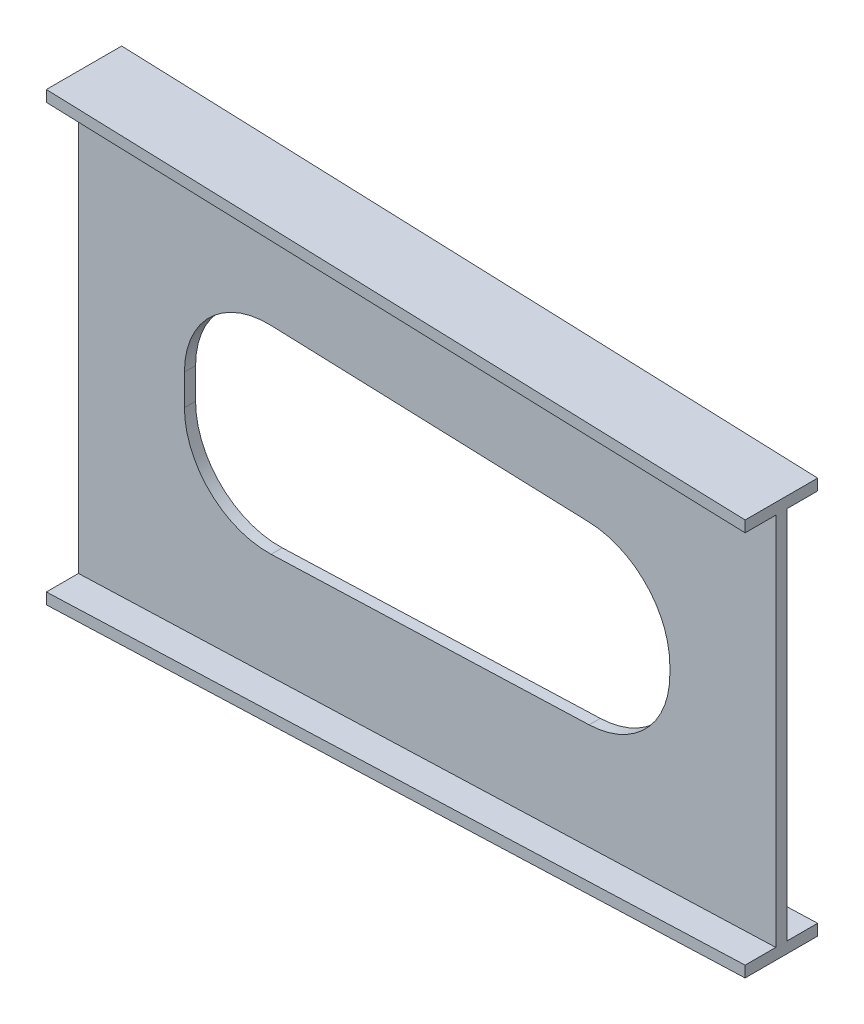
ISO-10303-21;
HEADER;
FILE_DESCRIPTION(('STEP AP214'),'2;1');
FILE_NAME('part.step','',(''),(''),'','','');
FILE_SCHEMA(('AUTOMOTIVE_DESIGN { 1 0 10303 214 1 1 1 1 }'));
ENDSEC;
DATA;
#1=APPLICATION_CONTEXT('core data for automotive mechanical design processes');
#2=APPLICATION_PROTOCOL_DEFINITION('international standard','automotive_design',2000,#1);
#3=PRODUCT_CONTEXT('',#1,'mechanical');
#4=PRODUCT('Part','Part','',(#3));
#5=PRODUCT_RELATED_PRODUCT_CATEGORY('part','',(#4));
#6=PRODUCT_DEFINITION_FORMATION('','',#4);
#7=PRODUCT_DEFINITION_CONTEXT('part definition',#1,'design');
#8=PRODUCT_DEFINITION('design','',#6,#7);
#9=PRODUCT_DEFINITION_SHAPE('','',#8);
#10=(LENGTH_UNIT() NAMED_UNIT(*) SI_UNIT(.MILLI.,.METRE.));
#11=(NAMED_UNIT(*) PLANE_ANGLE_UNIT() SI_UNIT($,.RADIAN.));
#12=(NAMED_UNIT(*) SI_UNIT($,.STERADIAN.) SOLID_ANGLE_UNIT());
#13=UNCERTAINTY_MEASURE_WITH_UNIT(LENGTH_MEASURE(1.E-05),#10,'distance_accuracy_value','');
#14=(GEOMETRIC_REPRESENTATION_CONTEXT(3) GLOBAL_UNCERTAINTY_ASSIGNED_CONTEXT((#13)) GLOBAL_UNIT_ASSIGNED_CONTEXT((#10,
#11,#12)) REPRESENTATION_CONTEXT('',''));
#15=CARTESIAN_POINT('',(0.,0.,0.));
#16=DIRECTION('',(0.,0.,1.));
#17=DIRECTION('',(1.,0.,0.));
#18=AXIS2_PLACEMENT_3D('',#15,#16,#17);
#19=CARTESIAN_POINT('',(1250.,0.,0.));
#20=DIRECTION('',(-1.,0.,0.));
#21=DIRECTION('',(0.,0.,1.));
#22=AXIS2_PLACEMENT_3D('',#19,#20,#21);
#23=PLANE('',#22);
#24=DIRECTION('',(0.,-1.,0.));
#25=VECTOR('',#24,1.);
#26=CARTESIAN_POINT('',(1250.,355.5,-54.9999999999994));
#27=LINE('',#26,#25);
#28=CARTESIAN_POINT('',(1250.,355.5,-54.9999999999994));
#29=VERTEX_POINT('',#28);
#30=CARTESIAN_POINT('',(1250.,335.5,-54.9999999999994));
#31=VERTEX_POINT('',#30);
#32=EDGE_CURVE('E545',#29,#31,#27,.T.);
#33=ORIENTED_EDGE('',*,*,#32,.F.);
#34=DIRECTION('',(0.,0.,-1.));
#35=VECTOR('',#34,1.);
#36=CARTESIAN_POINT('',(1250.,355.5,-54.9999999999994));
#37=LINE('',#36,#35);
#38=CARTESIAN_POINT('',(1250.,355.5,75.0000000000006));
#39=VERTEX_POINT('',#38);
#40=EDGE_CURVE('E674',#39,#29,#37,.T.);
#41=ORIENTED_EDGE('',*,*,#40,.F.);
#42=DIRECTION('',(0.,1.,0.));
#43=VECTOR('',#42,1.);
#44=CARTESIAN_POINT('',(1250.,355.5,75.0000000000006));
#45=LINE('',#44,#43);
#46=CARTESIAN_POINT('',(1250.,335.5,75.0000000000006));
#47=VERTEX_POINT('',#46);
#48=EDGE_CURVE('E295',#47,#39,#45,.T.);
#49=ORIENTED_EDGE('',*,*,#48,.F.);
#50=DIRECTION('',(0.,0.,1.));
#51=VECTOR('',#50,1.);
#52=CARTESIAN_POINT('',(1250.,335.5,20.0000000000005));
#53=LINE('',#52,#51);
#54=CARTESIAN_POINT('',(1250.,335.5,20.0000000000005));
#55=VERTEX_POINT('',#54);
#56=EDGE_CURVE('E309',#55,#47,#53,.T.);
#57=ORIENTED_EDGE('',*,*,#56,.F.);
#58=DIRECTION('',(0.,1.,0.));
#59=VECTOR('',#58,1.);
#60=CARTESIAN_POINT('',(1250.,335.5,20.0000000000005));
#61=LINE('',#60,#59);
#62=CARTESIAN_POINT('',(1250.,-335.5,20.0000000000005));
#63=VERTEX_POINT('',#62);
#64=EDGE_CURVE('E771',#63,#55,#61,.T.);
#65=ORIENTED_EDGE('',*,*,#64,.F.);
#66=DIRECTION('',(0.,0.,-1.));
#67=VECTOR('',#66,1.);
#68=CARTESIAN_POINT('',(1250.,-335.5,20.0000000000005));
#69=LINE('',#68,#67);
#70=CARTESIAN_POINT('',(1250.,-335.5,75.0000000000006));
#71=VERTEX_POINT('',#70);
#72=EDGE_CURVE('E774',#71,#63,#69,.T.);
#73=ORIENTED_EDGE('',*,*,#72,.F.);
#74=DIRECTION('',(0.,1.,0.));
#75=VECTOR('',#74,1.);
#76=CARTESIAN_POINT('',(1250.,-335.5,75.0000000000006));
#77=LINE('',#76,#75);
#78=CARTESIAN_POINT('',(1250.,-355.5,75.0000000000006));
#79=VERTEX_POINT('',#78);
#80=EDGE_CURVE('E777',#79,#71,#77,.T.);
#81=ORIENTED_EDGE('',*,*,#80,.F.);
#82=DIRECTION('',(0.,0.,1.));
#83=VECTOR('',#82,1.);
#84=CARTESIAN_POINT('',(1250.,-355.5,-54.9999999999994));
#85=LINE('',#84,#83);
#86=CARTESIAN_POINT('',(1250.,-355.5,-54.9999999999994));
#87=VERTEX_POINT('',#86);
#88=EDGE_CURVE('E424',#87,#79,#85,.T.);
#89=ORIENTED_EDGE('',*,*,#88,.F.);
#90=DIRECTION('',(0.,-1.,0.));
#91=VECTOR('',#90,1.);
#92=CARTESIAN_POINT('',(1250.,-335.5,-54.9999999999994));
#93=LINE('',#92,#91);
#94=CARTESIAN_POINT('',(1250.,-335.5,-54.9999999999994));
#95=VERTEX_POINT('',#94);
#96=EDGE_CURVE('E438',#95,#87,#93,.T.);
#97=ORIENTED_EDGE('',*,*,#96,.F.);
#98=DIRECTION('',(0.,0.,-1.));
#99=VECTOR('',#98,1.);
#100=CARTESIAN_POINT('',(1250.,-335.5,-54.9999999999994));
#101=LINE('',#100,#99);
#102=CARTESIAN_POINT('',(1250.,-335.5,4.44089209850063E-13));
#103=VERTEX_POINT('',#102);
#104=EDGE_CURVE('E866',#103,#95,#101,.T.);
#105=ORIENTED_EDGE('',*,*,#104,.F.);
#106=DIRECTION('',(0.,-1.,0.));
#107=VECTOR('',#106,1.);
#108=CARTESIAN_POINT('',(1250.,335.5,4.44089209850063E-13));
#109=LINE('',#108,#107);
#110=CARTESIAN_POINT('',(1250.,335.5,4.44089209850063E-13));
#111=VERTEX_POINT('',#110);
#112=EDGE_CURVE('E689',#111,#103,#109,.T.);
#113=ORIENTED_EDGE('',*,*,#112,.F.);
#114=DIRECTION('',(0.,0.,1.));
#115=VECTOR('',#114,1.);
#116=CARTESIAN_POINT('',(1250.,335.5,-54.9999999999994));
#117=LINE('',#116,#115);
#118=EDGE_CURVE('E531',#31,#111,#117,.T.);
#119=ORIENTED_EDGE('',*,*,#118,.F.);
#120=EDGE_LOOP('',(#33,#41,#49,#57,#65,#73,#81,#89,#97,#105,#113,#119));
#121=FACE_BOUND('',#120,.T.);
#122=ADVANCED_FACE('F65',(#121),#23,.F.);
#123=CARTESIAN_POINT('',(0.,0.,0.));
#124=DIRECTION('',(1.,0.,0.));
#125=DIRECTION('',(0.,0.,-1.));
#126=AXIS2_PLACEMENT_3D('',#123,#124,#125);
#127=PLANE('',#126);
#128=DIRECTION('',(0.,-1.,0.));
#129=VECTOR('',#128,1.);
#130=CARTESIAN_POINT('',(0.,400.,77.5000000000004));
#131=LINE('',#130,#129);
#132=CARTESIAN_POINT('',(0.,400.,77.5000000000004));
#133=VERTEX_POINT('',#132);
#134=CARTESIAN_POINT('',(0.,380.,77.5000000000004));
#135=VERTEX_POINT('',#134);
#136=EDGE_CURVE('E240',#133,#135,#131,.T.);
#137=ORIENTED_EDGE('',*,*,#136,.F.);
#138=DIRECTION('',(0.,0.,1.));
#139=VECTOR('',#138,1.);
#140=CARTESIAN_POINT('',(0.,400.,77.5000000000004));
#141=LINE('',#140,#139);
#142=CARTESIAN_POINT('',(0.,400.,-57.4999999999996));
#143=VERTEX_POINT('',#142);
#144=EDGE_CURVE('E256',#143,#133,#141,.T.);
#145=ORIENTED_EDGE('',*,*,#144,.F.);
#146=DIRECTION('',(0.,1.,0.));
#147=VECTOR('',#146,1.);
#148=CARTESIAN_POINT('',(0.,400.,-57.4999999999996));
#149=LINE('',#148,#147);
#150=CARTESIAN_POINT('',(0.,380.,-57.4999999999996));
#151=VERTEX_POINT('',#150);
#152=EDGE_CURVE('E560',#151,#143,#149,.T.);
#153=ORIENTED_EDGE('',*,*,#152,.F.);
#154=DIRECTION('',(0.,0.,-1.));
#155=VECTOR('',#154,1.);
#156=CARTESIAN_POINT('',(0.,380.,3.55120962204224E-13));
#157=LINE('',#156,#155);
#158=CARTESIAN_POINT('',(0.,380.,3.55120962204224E-13));
#159=VERTEX_POINT('',#158);
#160=EDGE_CURVE('E667',#159,#151,#157,.T.);
#161=ORIENTED_EDGE('',*,*,#160,.F.);
#162=DIRECTION('',(0.,1.,0.));
#163=VECTOR('',#162,1.);
#164=CARTESIAN_POINT('',(0.,380.,3.55120962204224E-13));
#165=LINE('',#164,#163);
#166=CARTESIAN_POINT('',(0.,-380.,3.55120962204224E-13));
#167=VERTEX_POINT('',#166);
#168=EDGE_CURVE('E498',#167,#159,#165,.T.);
#169=ORIENTED_EDGE('',*,*,#168,.F.);
#170=DIRECTION('',(0.,0.,1.));
#171=VECTOR('',#170,1.);
#172=CARTESIAN_POINT('',(0.,-380.,3.55120962204224E-13));
#173=LINE('',#172,#171);
#174=CARTESIAN_POINT('',(0.,-380.,-57.4999999999999));
#175=VERTEX_POINT('',#174);
#176=EDGE_CURVE('E480',#175,#167,#173,.T.);
#177=ORIENTED_EDGE('',*,*,#176,.F.);
#178=DIRECTION('',(0.,1.,0.));
#179=VECTOR('',#178,1.);
#180=CARTESIAN_POINT('',(0.,-380.,-57.4999999999999));
#181=LINE('',#180,#179);
#182=CARTESIAN_POINT('',(0.,-400.,-57.4999999999999));
#183=VERTEX_POINT('',#182);
#184=EDGE_CURVE('E660',#183,#175,#181,.T.);
#185=ORIENTED_EDGE('',*,*,#184,.F.);
#186=DIRECTION('',(0.,0.,-1.));
#187=VECTOR('',#186,1.);
#188=CARTESIAN_POINT('',(0.,-400.,77.5000000000001));
#189=LINE('',#188,#187);
#190=CARTESIAN_POINT('',(0.,-400.,77.5000000000001));
#191=VERTEX_POINT('',#190);
#192=EDGE_CURVE('E656',#191,#183,#189,.T.);
#193=ORIENTED_EDGE('',*,*,#192,.F.);
#194=DIRECTION('',(0.,-1.,0.));
#195=VECTOR('',#194,1.);
#196=CARTESIAN_POINT('',(0.,-380.,77.5000000000002));
#197=LINE('',#196,#195);
#198=CARTESIAN_POINT('',(0.,-380.,77.5000000000002));
#199=VERTEX_POINT('',#198);
#200=EDGE_CURVE('E389',#199,#191,#197,.T.);
#201=ORIENTED_EDGE('',*,*,#200,.F.);
#202=DIRECTION('',(0.,0.,1.));
#203=VECTOR('',#202,1.);
#204=CARTESIAN_POINT('',(0.,-380.,77.5000000000002));
#205=LINE('',#204,#203);
#206=CARTESIAN_POINT('',(0.,-380.,20.0000000000004));
#207=VERTEX_POINT('',#206);
#208=EDGE_CURVE('E371',#207,#199,#205,.T.);
#209=ORIENTED_EDGE('',*,*,#208,.F.);
#210=DIRECTION('',(0.,-1.,0.));
#211=VECTOR('',#210,1.);
#212=CARTESIAN_POINT('',(0.,380.,20.0000000000004));
#213=LINE('',#212,#211);
#214=CARTESIAN_POINT('',(0.,380.,20.0000000000004));
#215=VERTEX_POINT('',#214);
#216=EDGE_CURVE('E354',#215,#207,#213,.T.);
#217=ORIENTED_EDGE('',*,*,#216,.F.);
#218=DIRECTION('',(0.,0.,-1.));
#219=VECTOR('',#218,1.);
#220=CARTESIAN_POINT('',(0.,380.,77.5000000000004));
#221=LINE('',#220,#219);
#222=EDGE_CURVE('E644',#135,#215,#221,.T.);
#223=ORIENTED_EDGE('',*,*,#222,.F.);
#224=EDGE_LOOP('',(#137,#145,#153,#161,#169,#177,#185,#193,#201,#209,#217,#223));
#225=FACE_BOUND('',#224,.T.);
#226=ADVANCED_FACE('F572',(#225),#127,.F.);
#227=CARTESIAN_POINT('',(0.,0.,20.0000000000004));
#228=DIRECTION('',(0.,0.,1.));
#229=DIRECTION('',(1.,0.,0.));
#230=AXIS2_PLACEMENT_3D('',#227,#228,#229);
#231=PLANE('',#230);
#232=CARTESIAN_POINT('',(910.,-7.38861702033511,20.0000000000004));
#233=DIRECTION('',(0.,0.,1.));
#234=DIRECTION('',(1.,0.,0.));
#235=AXIS2_PLACEMENT_3D('',#232,#233,#234);
#236=CIRCLE('',#235,150.);
#237=CARTESIAN_POINT('',(915.336619361825,-157.293655273847,20.0000000000004));
#238=VERTEX_POINT('',#237);
#239=CARTESIAN_POINT('',(1060.,-7.38861702033511,20.0000000000004));
#240=VERTEX_POINT('',#239);
#241=EDGE_CURVE('E80',#238,#240,#236,.T.);
#242=ORIENTED_EDGE('',*,*,#241,.F.);
#243=DIRECTION('',(0.999366921690082,0.0355774624121669,0.));
#244=VECTOR('',#243,1.);
#245=CARTESIAN_POINT('',(345.336619361825,-177.585655273847,20.0000000000004));
#246=LINE('',#245,#244);
#247=CARTESIAN_POINT('',(345.336619361825,-177.585655273847,20.0000000000004));
#248=VERTEX_POINT('',#247);
#249=EDGE_CURVE('E235',#248,#238,#246,.T.);
#250=ORIENTED_EDGE('',*,*,#249,.F.);
#251=CARTESIAN_POINT('',(340.,-27.6806170203351,20.0000000000004));
#252=DIRECTION('',(0.,0.,1.));
#253=DIRECTION('',(-1.,0.,0.));
#254=AXIS2_PLACEMENT_3D('',#251,#252,#253);
#255=CIRCLE('',#254,150.);
#256=CARTESIAN_POINT('',(190.,-27.6806170203351,20.0000000000004));
#257=VERTEX_POINT('',#256);
#258=EDGE_CURVE('E232',#257,#248,#255,.T.);
#259=ORIENTED_EDGE('',*,*,#258,.F.);
#260=DIRECTION('',(0.,-1.,0.));
#261=VECTOR('',#260,1.);
#262=CARTESIAN_POINT('',(190.,27.6806170203352,20.0000000000004));
#263=LINE('',#262,#261);
#264=CARTESIAN_POINT('',(190.,27.6806170203352,20.0000000000004));
#265=VERTEX_POINT('',#264);
#266=EDGE_CURVE('E229',#265,#257,#263,.T.);
#267=ORIENTED_EDGE('',*,*,#266,.F.);
#268=CARTESIAN_POINT('',(340.,27.6806170203352,20.0000000000004));
#269=DIRECTION('',(0.,0.,1.));
#270=DIRECTION('',(-1.,0.,0.));
#271=AXIS2_PLACEMENT_3D('',#268,#269,#270);
#272=CIRCLE('',#271,150.);
#273=CARTESIAN_POINT('',(345.336619361825,177.585655273847,20.0000000000004));
#274=VERTEX_POINT('',#273);
#275=EDGE_CURVE('E223',#274,#265,#272,.T.);
#276=ORIENTED_EDGE('',*,*,#275,.F.);
#277=DIRECTION('',(-0.999366921690082,0.0355774624121669,0.));
#278=VECTOR('',#277,1.);
#279=CARTESIAN_POINT('',(915.336619361825,157.293655273847,20.0000000000004));
#280=LINE('',#279,#278);
#281=CARTESIAN_POINT('',(915.336619361825,157.293655273847,20.0000000000004));
#282=VERTEX_POINT('',#281);
#283=EDGE_CURVE('E221',#282,#274,#280,.T.);
#284=ORIENTED_EDGE('',*,*,#283,.F.);
#285=CARTESIAN_POINT('',(910.,7.38861702033516,20.0000000000004));
#286=DIRECTION('',(0.,0.,1.));
#287=DIRECTION('',(-1.,0.,0.));
#288=AXIS2_PLACEMENT_3D('',#285,#286,#287);
#289=CIRCLE('',#288,150.);
#290=CARTESIAN_POINT('',(1060.,7.38861702033518,20.0000000000004));
#291=VERTEX_POINT('',#290);
#292=EDGE_CURVE('E204',#291,#282,#289,.T.);
#293=ORIENTED_EDGE('',*,*,#292,.F.);
#294=DIRECTION('',(0.,1.,0.));
#295=VECTOR('',#294,1.);
#296=CARTESIAN_POINT('',(1060.,-7.38861702033511,20.0000000000004));
#297=LINE('',#296,#295);
#298=EDGE_CURVE('E213',#240,#291,#297,.T.);
#299=ORIENTED_EDGE('',*,*,#298,.F.);
#300=EDGE_LOOP('',(#242,#250,#259,#267,#276,#284,#293,#299));
#301=FACE_BOUND('',#300,.T.);
#302=DIRECTION('',(0.999366921690082,0.035577462412167,0.));
#303=VECTOR('',#302,1.);
#304=CARTESIAN_POINT('',(0.,-380.,20.0000000000004));
#305=LINE('',#304,#303);
#306=EDGE_CURVE('E347',#207,#63,#305,.T.);
#307=ORIENTED_EDGE('',*,*,#306,.T.);
#308=ORIENTED_EDGE('',*,*,#64,.T.);
#309=DIRECTION('',(0.999366921690082,-0.035577462412167,0.));
#310=VECTOR('',#309,1.);
#311=CARTESIAN_POINT('',(0.,380.,20.0000000000004));
#312=LINE('',#311,#310);
#313=EDGE_CURVE('E339',#215,#55,#312,.T.);
#314=ORIENTED_EDGE('',*,*,#313,.F.);
#315=ORIENTED_EDGE('',*,*,#216,.T.);
#316=EDGE_LOOP('',(#307,#308,#314,#315));
#317=FACE_BOUND('',#316,.T.);
#318=ADVANCED_FACE('F217',(#301,#317),#231,.T.);
#319=CARTESIAN_POINT('',(13.5108768551089,379.519012783958,0.));
#320=DIRECTION('',(-0.035577462412167,-0.999366921690082,0.));
#321=DIRECTION('',(0.999366921690082,-0.035577462412167,0.));
#322=AXIS2_PLACEMENT_3D('',#319,#320,#321);
#323=PLANE('',#322);
#324=ORIENTED_EDGE('',*,*,#313,.T.);
#325=ORIENTED_EDGE('',*,*,#56,.T.);
#326=DIRECTION('',(0.999364925492129,-0.0355773913475198,-0.00199872985098406));
#327=VECTOR('',#326,1.);
#328=CARTESIAN_POINT('',(0.,380.,77.5000000000004));
#329=LINE('',#328,#327);
#330=EDGE_CURVE('E676',#135,#47,#329,.T.);
#331=ORIENTED_EDGE('',*,*,#330,.F.);
#332=ORIENTED_EDGE('',*,*,#222,.T.);
#333=EDGE_LOOP('',(#324,#325,#331,#332));
#334=FACE_BOUND('',#333,.T.);
#335=ADVANCED_FACE('F316',(#334),#323,.T.);
#336=CARTESIAN_POINT('',(13.5108768551089,-379.519012783958,0.));
#337=DIRECTION('',(-0.035577462412167,0.999366921690082,0.));
#338=DIRECTION('',(-0.999366921690082,-0.035577462412167,0.));
#339=AXIS2_PLACEMENT_3D('',#336,#337,#338);
#340=PLANE('',#339);
#341=DIRECTION('',(0.999364925492129,0.0355773913475198,-0.00199872985098388));
#342=VECTOR('',#341,1.);
#343=CARTESIAN_POINT('',(0.,-380.,77.5000000000002));
#344=LINE('',#343,#342);
#345=EDGE_CURVE('E346',#199,#71,#344,.T.);
#346=ORIENTED_EDGE('',*,*,#345,.T.);
#347=ORIENTED_EDGE('',*,*,#72,.T.);
#348=ORIENTED_EDGE('',*,*,#306,.F.);
#349=ORIENTED_EDGE('',*,*,#208,.T.);
#350=EDGE_LOOP('',(#346,#347,#348,#349));
#351=FACE_BOUND('',#350,.T.);
#352=ADVANCED_FACE('F326',(#351),#340,.T.);
#353=CARTESIAN_POINT('',(0.15499938000245,0.,77.4996900012401));
#354=DIRECTION('',(0.00199999600001161,0.,0.999998000006));
#355=DIRECTION('',(0.999998000006,0.,-0.00199999600001161));
#356=AXIS2_PLACEMENT_3D('',#353,#354,#355);
#357=PLANE('',#356);
#358=DIRECTION('',(0.999364925492129,0.0355773913475198,-0.00199872985098387));
#359=VECTOR('',#358,1.);
#360=CARTESIAN_POINT('',(0.,-400.,77.5000000000001));
#361=LINE('',#360,#359);
#362=EDGE_CURVE('E382',#191,#79,#361,.T.);
#363=ORIENTED_EDGE('',*,*,#362,.T.);
#364=ORIENTED_EDGE('',*,*,#80,.T.);
#365=ORIENTED_EDGE('',*,*,#345,.F.);
#366=ORIENTED_EDGE('',*,*,#200,.T.);
#367=EDGE_LOOP('',(#363,#364,#365,#366));
#368=FACE_BOUND('',#367,.T.);
#369=ADVANCED_FACE('F395',(#368),#357,.T.);
#370=CARTESIAN_POINT('',(14.2219756369567,-399.493697667324,0.));
#371=DIRECTION('',(0.0355774624121669,-0.999366921690082,0.));
#372=DIRECTION('',(0.999366921690082,0.0355774624121669,0.));
#373=AXIS2_PLACEMENT_3D('',#370,#371,#372);
#374=PLANE('',#373);
#375=DIRECTION('',(0.999364925492129,0.0355773913475198,0.00199872985098465));
#376=VECTOR('',#375,1.);
#377=CARTESIAN_POINT('',(0.,-400.,-57.4999999999999));
#378=LINE('',#377,#376);
#379=EDGE_CURVE('E472',#183,#87,#378,.T.);
#380=ORIENTED_EDGE('',*,*,#379,.T.);
#381=ORIENTED_EDGE('',*,*,#88,.T.);
#382=ORIENTED_EDGE('',*,*,#362,.F.);
#383=ORIENTED_EDGE('',*,*,#192,.T.);
#384=EDGE_LOOP('',(#380,#381,#382,#383));
#385=FACE_BOUND('',#384,.T.);
#386=ADVANCED_FACE('F404',(#385),#374,.T.);
#387=CARTESIAN_POINT('',(0.114999540001863,0.,-57.4997700009199));
#388=DIRECTION('',(0.0019999960000124,0.,-0.999998000006));
#389=DIRECTION('',(-0.999998000006,0.,-0.0019999960000124));
#390=AXIS2_PLACEMENT_3D('',#387,#388,#389);
#391=PLANE('',#390);
#392=DIRECTION('',(0.999364925492129,0.0355773913475198,0.00199872985098466));
#393=VECTOR('',#392,1.);
#394=CARTESIAN_POINT('',(0.,-380.,-57.4999999999999));
#395=LINE('',#394,#393);
#396=EDGE_CURVE('E464',#175,#95,#395,.T.);
#397=ORIENTED_EDGE('',*,*,#396,.T.);
#398=ORIENTED_EDGE('',*,*,#96,.T.);
#399=ORIENTED_EDGE('',*,*,#379,.F.);
#400=ORIENTED_EDGE('',*,*,#184,.T.);
#401=EDGE_LOOP('',(#397,#398,#399,#400));
#402=FACE_BOUND('',#401,.T.);
#403=ADVANCED_FACE('F444',(#402),#391,.T.);
#404=CARTESIAN_POINT('',(13.5108768551089,-379.519012783958,0.));
#405=DIRECTION('',(-0.035577462412167,0.999366921690082,0.));
#406=DIRECTION('',(-0.999366921690082,-0.035577462412167,0.));
#407=AXIS2_PLACEMENT_3D('',#404,#405,#406);
#408=PLANE('',#407);
#409=DIRECTION('',(0.999366921690082,0.035577462412167,0.));
#410=VECTOR('',#409,1.);
#411=CARTESIAN_POINT('',(0.,-380.,3.55120962204224E-13));
#412=LINE('',#411,#410);
#413=EDGE_CURVE('E471',#167,#103,#412,.T.);
#414=ORIENTED_EDGE('',*,*,#413,.T.);
#415=ORIENTED_EDGE('',*,*,#104,.T.);
#416=ORIENTED_EDGE('',*,*,#396,.F.);
#417=ORIENTED_EDGE('',*,*,#176,.T.);
#418=EDGE_LOOP('',(#414,#415,#416,#417));
#419=FACE_BOUND('',#418,.T.);
#420=ADVANCED_FACE('F453',(#419),#408,.T.);
#421=CARTESIAN_POINT('',(0.,0.,3.55120962204224E-13));
#422=DIRECTION('',(0.,0.,-1.));
#423=DIRECTION('',(-1.,0.,0.));
#424=AXIS2_PLACEMENT_3D('',#421,#422,#423);
#425=PLANE('',#424);
#426=CARTESIAN_POINT('',(910.,-7.38861702033511,4.16333634234434E-13));
#427=DIRECTION('',(0.,0.,-1.));
#428=DIRECTION('',(-1.,0.,0.));
#429=AXIS2_PLACEMENT_3D('',#426,#427,#428);
#430=CIRCLE('',#429,150.);
#431=CARTESIAN_POINT('',(1060.,-7.38861702033511,4.30211422042248E-13));
#432=VERTEX_POINT('',#431);
#433=CARTESIAN_POINT('',(915.336619361825,-157.293655273847,4.02455846426619E-13));
#434=VERTEX_POINT('',#433);
#435=EDGE_CURVE('E12',#432,#434,#430,.T.);
#436=ORIENTED_EDGE('',*,*,#435,.F.);
#437=DIRECTION('',(0.,-1.,0.));
#438=VECTOR('',#437,1.);
#439=CARTESIAN_POINT('',(1060.,0.,4.30566036207895E-13));
#440=LINE('',#439,#438);
#441=CARTESIAN_POINT('',(1060.,7.38861702033518,4.30566036207895E-13));
#442=VERTEX_POINT('',#441);
#443=EDGE_CURVE('E709',#442,#432,#440,.T.);
#444=ORIENTED_EDGE('',*,*,#443,.F.);
#445=CARTESIAN_POINT('',(910.,7.38861702033516,4.16333634234434E-13));
#446=DIRECTION('',(0.,0.,-1.));
#447=DIRECTION('',(-1.,0.,0.));
#448=AXIS2_PLACEMENT_3D('',#445,#446,#447);
#449=CIRCLE('',#448,150.);
#450=CARTESIAN_POINT('',(915.336619361825,157.293655273847,4.02455846426619E-13));
#451=VERTEX_POINT('',#450);
#452=EDGE_CURVE('E207',#451,#442,#449,.T.);
#453=ORIENTED_EDGE('',*,*,#452,.F.);
#454=DIRECTION('',(0.999366921690082,-0.0355774624121669,0.));
#455=VECTOR('',#454,1.);
#456=CARTESIAN_POINT('',(6.75115899679719,189.639297662842,3.55601473232643E-13));
#457=LINE('',#456,#455);
#458=CARTESIAN_POINT('',(345.336619361825,177.585655273847,4.02455846426619E-13));
#459=VERTEX_POINT('',#458);
#460=EDGE_CURVE('E717',#459,#451,#457,.T.);
#461=ORIENTED_EDGE('',*,*,#460,.F.);
#462=CARTESIAN_POINT('',(340.,27.6806170203352,3.7470027081099E-13));
#463=DIRECTION('',(0.,0.,-1.));
#464=DIRECTION('',(-1.,0.,0.));
#465=AXIS2_PLACEMENT_3D('',#462,#463,#464);
#466=CIRCLE('',#465,150.);
#467=CARTESIAN_POINT('',(190.,27.6806170203352,3.60822483003176E-13));
#468=VERTEX_POINT('',#467);
#469=EDGE_CURVE('E719',#468,#459,#466,.T.);
#470=ORIENTED_EDGE('',*,*,#469,.F.);
#471=DIRECTION('',(0.,1.,0.));
#472=VECTOR('',#471,1.);
#473=CARTESIAN_POINT('',(190.,0.,3.68644135846392E-13));
#474=LINE('',#473,#472);
#475=CARTESIAN_POINT('',(190.,-27.6806170203351,3.67761376907083E-13));
#476=VERTEX_POINT('',#475);
#477=EDGE_CURVE('E721',#476,#468,#474,.T.);
#478=ORIENTED_EDGE('',*,*,#477,.F.);
#479=CARTESIAN_POINT('',(340.,-27.6806170203351,3.7470027081099E-13));
#480=DIRECTION('',(0.,0.,-1.));
#481=DIRECTION('',(-1.,0.,0.));
#482=AXIS2_PLACEMENT_3D('',#479,#480,#481);
#483=CIRCLE('',#482,150.);
#484=CARTESIAN_POINT('',(345.336619361825,-177.585655273847,3.60822483003176E-13));
#485=VERTEX_POINT('',#484);
#486=EDGE_CURVE('E723',#485,#476,#483,.T.);
#487=ORIENTED_EDGE('',*,*,#486,.F.);
#488=DIRECTION('',(-0.999366921690082,-0.0355774624121669,0.));
#489=VECTOR('',#488,1.);
#490=CARTESIAN_POINT('',(6.75115899679718,-189.639297662842,3.55601473232643E-13));
#491=LINE('',#490,#489);
#492=EDGE_CURVE('E73',#434,#485,#491,.T.);
#493=ORIENTED_EDGE('',*,*,#492,.F.);
#494=EDGE_LOOP('',(#436,#444,#453,#461,#470,#478,#487,#493));
#495=FACE_BOUND('',#494,.T.);
#496=DIRECTION('',(0.999366921690082,-0.035577462412167,0.));
#497=VECTOR('',#496,1.);
#498=CARTESIAN_POINT('',(0.,380.,3.55120962204224E-13));
#499=LINE('',#498,#497);
#500=EDGE_CURVE('E491',#159,#111,#499,.T.);
#501=ORIENTED_EDGE('',*,*,#500,.T.);
#502=ORIENTED_EDGE('',*,*,#112,.T.);
#503=ORIENTED_EDGE('',*,*,#413,.F.);
#504=ORIENTED_EDGE('',*,*,#168,.T.);
#505=EDGE_LOOP('',(#501,#502,#503,#504));
#506=FACE_BOUND('',#505,.T.);
#507=ADVANCED_FACE('F504',(#495,#506),#425,.T.);
#508=CARTESIAN_POINT('',(13.5108768551089,379.519012783958,0.));
#509=DIRECTION('',(-0.035577462412167,-0.999366921690082,0.));
#510=DIRECTION('',(0.999366921690082,-0.035577462412167,0.));
#511=AXIS2_PLACEMENT_3D('',#508,#509,#510);
#512=PLANE('',#511);
#513=DIRECTION('',(0.999364925492129,-0.0355773913475199,0.00199872985098446));
#514=VECTOR('',#513,1.);
#515=CARTESIAN_POINT('',(0.,380.,-57.4999999999996));
#516=LINE('',#515,#514);
#517=EDGE_CURVE('E672',#151,#31,#516,.T.);
#518=ORIENTED_EDGE('',*,*,#517,.T.);
#519=ORIENTED_EDGE('',*,*,#118,.T.);
#520=ORIENTED_EDGE('',*,*,#500,.F.);
#521=ORIENTED_EDGE('',*,*,#160,.T.);
#522=EDGE_LOOP('',(#518,#519,#520,#521));
#523=FACE_BOUND('',#522,.T.);
#524=ADVANCED_FACE('F512',(#523),#512,.T.);
#525=CARTESIAN_POINT('',(0.114999540001851,0.,-57.4997700009196));
#526=DIRECTION('',(0.0019999960000122,0.,-0.999998000006));
#527=DIRECTION('',(-0.999998000006,0.,-0.0019999960000122));
#528=AXIS2_PLACEMENT_3D('',#525,#526,#527);
#529=PLANE('',#528);
#530=DIRECTION('',(0.999364925492129,-0.0355773913475199,0.00199872985098446));
#531=VECTOR('',#530,1.);
#532=CARTESIAN_POINT('',(0.,400.,-57.4999999999996));
#533=LINE('',#532,#531);
#534=EDGE_CURVE('E262',#143,#29,#533,.T.);
#535=ORIENTED_EDGE('',*,*,#534,.T.);
#536=ORIENTED_EDGE('',*,*,#32,.T.);
#537=ORIENTED_EDGE('',*,*,#517,.F.);
#538=ORIENTED_EDGE('',*,*,#152,.T.);
#539=EDGE_LOOP('',(#535,#536,#537,#538));
#540=FACE_BOUND('',#539,.T.);
#541=ADVANCED_FACE('F274',(#540),#529,.T.);
#542=CARTESIAN_POINT('',(14.2219756369568,399.493697667324,0.));
#543=DIRECTION('',(0.035577462412167,0.999366921690082,0.));
#544=DIRECTION('',(-0.999366921690082,0.035577462412167,0.));
#545=AXIS2_PLACEMENT_3D('',#542,#543,#544);
#546=PLANE('',#545);
#547=DIRECTION('',(0.999364925492129,-0.0355773913475198,-0.00199872985098406));
#548=VECTOR('',#547,1.);
#549=CARTESIAN_POINT('',(0.,400.,77.5000000000004));
#550=LINE('',#549,#548);
#551=EDGE_CURVE('E675',#133,#39,#550,.T.);
#552=ORIENTED_EDGE('',*,*,#551,.T.);
#553=ORIENTED_EDGE('',*,*,#40,.T.);
#554=ORIENTED_EDGE('',*,*,#534,.F.);
#555=ORIENTED_EDGE('',*,*,#144,.T.);
#556=EDGE_LOOP('',(#552,#553,#554,#555));
#557=FACE_BOUND('',#556,.T.);
#558=ADVANCED_FACE('F264',(#557),#546,.T.);
#559=CARTESIAN_POINT('',(0.154999380002465,0.,77.4996900012404));
#560=DIRECTION('',(0.0019999960000118,0.,0.999998000006));
#561=DIRECTION('',(0.999998000006,0.,-0.0019999960000118));
#562=AXIS2_PLACEMENT_3D('',#559,#560,#561);
#563=PLANE('',#562);
#564=ORIENTED_EDGE('',*,*,#330,.T.);
#565=ORIENTED_EDGE('',*,*,#48,.T.);
#566=ORIENTED_EDGE('',*,*,#551,.F.);
#567=ORIENTED_EDGE('',*,*,#136,.T.);
#568=EDGE_LOOP('',(#564,#565,#566,#567));
#569=FACE_BOUND('',#568,.T.);
#570=ADVANCED_FACE('F273',(#569),#563,.T.);
#571=CARTESIAN_POINT('',(910.,-7.38861702033511,-57.5000999999999));
#572=DIRECTION('',(0.,0.,1.));
#573=DIRECTION('',(1.,0.,0.));
#574=AXIS2_PLACEMENT_3D('',#571,#572,#573);
#575=CYLINDRICAL_SURFACE('',#574,150.);
#576=ORIENTED_EDGE('',*,*,#435,.T.);
#577=DIRECTION('',(0.,0.,1.));
#578=VECTOR('',#577,1.);
#579=CARTESIAN_POINT('',(915.336619361825,-157.293655273847,-57.5000999999999));
#580=LINE('',#579,#578);
#581=EDGE_CURVE('E238',#434,#238,#580,.T.);
#582=ORIENTED_EDGE('',*,*,#581,.T.);
#583=ORIENTED_EDGE('',*,*,#241,.T.);
#584=DIRECTION('',(0.,0.,1.));
#585=VECTOR('',#584,1.);
#586=CARTESIAN_POINT('',(1060.,-7.38861702033511,-57.5000999999999));
#587=LINE('',#586,#585);
#588=EDGE_CURVE('E210',#432,#240,#587,.T.);
#589=ORIENTED_EDGE('',*,*,#588,.F.);
#590=EDGE_LOOP('',(#576,#582,#583,#589));
#591=FACE_BOUND('',#590,.T.);
#592=ADVANCED_FACE('F581',(#591),#575,.F.);
#593=CARTESIAN_POINT('',(345.336619361825,-177.585655273847,-57.5000999999999));
#594=DIRECTION('',(0.0355774624121669,-0.999366921690082,0.));
#595=DIRECTION('',(0.999366921690082,0.0355774624121669,0.));
#596=AXIS2_PLACEMENT_3D('',#593,#594,#595);
#597=PLANE('',#596);
#598=ORIENTED_EDGE('',*,*,#492,.T.);
#599=DIRECTION('',(0.,0.,1.));
#600=VECTOR('',#599,1.);
#601=CARTESIAN_POINT('',(345.336619361825,-177.585655273847,-57.5000999999999));
#602=LINE('',#601,#600);
#603=EDGE_CURVE('E241',#485,#248,#602,.T.);
#604=ORIENTED_EDGE('',*,*,#603,.T.);
#605=ORIENTED_EDGE('',*,*,#249,.T.);
#606=ORIENTED_EDGE('',*,*,#581,.F.);
#607=EDGE_LOOP('',(#598,#604,#605,#606));
#608=FACE_BOUND('',#607,.T.);
#609=ADVANCED_FACE('F728',(#608),#597,.F.);
#610=CARTESIAN_POINT('',(340.,-27.6806170203351,-57.5000999999999));
#611=DIRECTION('',(0.,0.,1.));
#612=DIRECTION('',(1.,0.,0.));
#613=AXIS2_PLACEMENT_3D('',#610,#611,#612);
#614=CYLINDRICAL_SURFACE('',#613,150.);
#615=ORIENTED_EDGE('',*,*,#486,.T.);
#616=DIRECTION('',(0.,0.,1.));
#617=VECTOR('',#616,1.);
#618=CARTESIAN_POINT('',(190.,-27.6806170203351,-57.5000999999999));
#619=LINE('',#618,#617);
#620=EDGE_CURVE('E243',#476,#257,#619,.T.);
#621=ORIENTED_EDGE('',*,*,#620,.T.);
#622=ORIENTED_EDGE('',*,*,#258,.T.);
#623=ORIENTED_EDGE('',*,*,#603,.F.);
#624=EDGE_LOOP('',(#615,#621,#622,#623));
#625=FACE_BOUND('',#624,.T.);
#626=ADVANCED_FACE('F732',(#625),#614,.F.);
#627=CARTESIAN_POINT('',(190.,27.6806170203352,-57.5000999999999));
#628=DIRECTION('',(-1.,0.,0.));
#629=DIRECTION('',(0.,-1.,0.));
#630=AXIS2_PLACEMENT_3D('',#627,#628,#629);
#631=PLANE('',#630);
#632=ORIENTED_EDGE('',*,*,#477,.T.);
#633=DIRECTION('',(0.,0.,1.));
#634=VECTOR('',#633,1.);
#635=CARTESIAN_POINT('',(190.,27.6806170203352,-57.5000999999999));
#636=LINE('',#635,#634);
#637=EDGE_CURVE('E245',#468,#265,#636,.T.);
#638=ORIENTED_EDGE('',*,*,#637,.T.);
#639=ORIENTED_EDGE('',*,*,#266,.T.);
#640=ORIENTED_EDGE('',*,*,#620,.F.);
#641=EDGE_LOOP('',(#632,#638,#639,#640));
#642=FACE_BOUND('',#641,.T.);
#643=ADVANCED_FACE('F741',(#642),#631,.F.);
#644=CARTESIAN_POINT('',(340.,27.6806170203352,-57.5000999999999));
#645=DIRECTION('',(0.,0.,1.));
#646=DIRECTION('',(1.,0.,0.));
#647=AXIS2_PLACEMENT_3D('',#644,#645,#646);
#648=CYLINDRICAL_SURFACE('',#647,150.);
#649=ORIENTED_EDGE('',*,*,#469,.T.);
#650=DIRECTION('',(0.,0.,1.));
#651=VECTOR('',#650,1.);
#652=CARTESIAN_POINT('',(345.336619361825,177.585655273847,-57.5000999999999));
#653=LINE('',#652,#651);
#654=EDGE_CURVE('E247',#459,#274,#653,.T.);
#655=ORIENTED_EDGE('',*,*,#654,.T.);
#656=ORIENTED_EDGE('',*,*,#275,.T.);
#657=ORIENTED_EDGE('',*,*,#637,.F.);
#658=EDGE_LOOP('',(#649,#655,#656,#657));
#659=FACE_BOUND('',#658,.T.);
#660=ADVANCED_FACE('F743',(#659),#648,.F.);
#661=CARTESIAN_POINT('',(915.336619361825,157.293655273847,-57.5000999999999));
#662=DIRECTION('',(0.0355774624121669,0.999366921690082,0.));
#663=DIRECTION('',(-0.999366921690082,0.0355774624121669,0.));
#664=AXIS2_PLACEMENT_3D('',#661,#662,#663);
#665=PLANE('',#664);
#666=ORIENTED_EDGE('',*,*,#460,.T.);
#667=DIRECTION('',(0.,0.,1.));
#668=VECTOR('',#667,1.);
#669=CARTESIAN_POINT('',(915.336619361825,157.293655273847,-57.5000999999999));
#670=LINE('',#669,#668);
#671=EDGE_CURVE('E209',#451,#282,#670,.T.);
#672=ORIENTED_EDGE('',*,*,#671,.T.);
#673=ORIENTED_EDGE('',*,*,#283,.T.);
#674=ORIENTED_EDGE('',*,*,#654,.F.);
#675=EDGE_LOOP('',(#666,#672,#673,#674));
#676=FACE_BOUND('',#675,.T.);
#677=ADVANCED_FACE('F747',(#676),#665,.F.);
#678=CARTESIAN_POINT('',(910.,7.38861702033516,-57.5000999999999));
#679=DIRECTION('',(0.,0.,1.));
#680=DIRECTION('',(1.,0.,0.));
#681=AXIS2_PLACEMENT_3D('',#678,#679,#680);
#682=CYLINDRICAL_SURFACE('',#681,150.);
#683=ORIENTED_EDGE('',*,*,#452,.T.);
#684=DIRECTION('',(0.,0.,1.));
#685=VECTOR('',#684,1.);
#686=CARTESIAN_POINT('',(1060.,7.38861702033518,-57.5000999999999));
#687=LINE('',#686,#685);
#688=EDGE_CURVE('E88',#442,#291,#687,.T.);
#689=ORIENTED_EDGE('',*,*,#688,.T.);
#690=ORIENTED_EDGE('',*,*,#292,.T.);
#691=ORIENTED_EDGE('',*,*,#671,.F.);
#692=EDGE_LOOP('',(#683,#689,#690,#691));
#693=FACE_BOUND('',#692,.T.);
#694=ADVANCED_FACE('F201',(#693),#682,.F.);
#695=CARTESIAN_POINT('',(1060.,-7.38861702033511,-57.5000999999999));
#696=DIRECTION('',(1.,0.,0.));
#697=DIRECTION('',(0.,0.,-1.));
#698=AXIS2_PLACEMENT_3D('',#695,#696,#697);
#699=PLANE('',#698);
#700=ORIENTED_EDGE('',*,*,#443,.T.);
#701=ORIENTED_EDGE('',*,*,#588,.T.);
#702=ORIENTED_EDGE('',*,*,#298,.T.);
#703=ORIENTED_EDGE('',*,*,#688,.F.);
#704=EDGE_LOOP('',(#700,#701,#702,#703));
#705=FACE_BOUND('',#704,.T.);
#706=ADVANCED_FACE('F214',(#705),#699,.F.);
#707=CLOSED_SHELL('',(#122,#226,#318,#335,#352,#369,#386,#403,#420,#507,#524,#541,#558,#570,
#592,#609,#626,#643,#660,#677,#694,#706));
#708=MANIFOLD_SOLID_BREP('B2',#707);
#709=ADVANCED_BREP_SHAPE_REPRESENTATION('',(#18,#708),#14);
#710=SHAPE_DEFINITION_REPRESENTATION(#9,#709);
ENDSEC;
END-ISO-10303-21;
